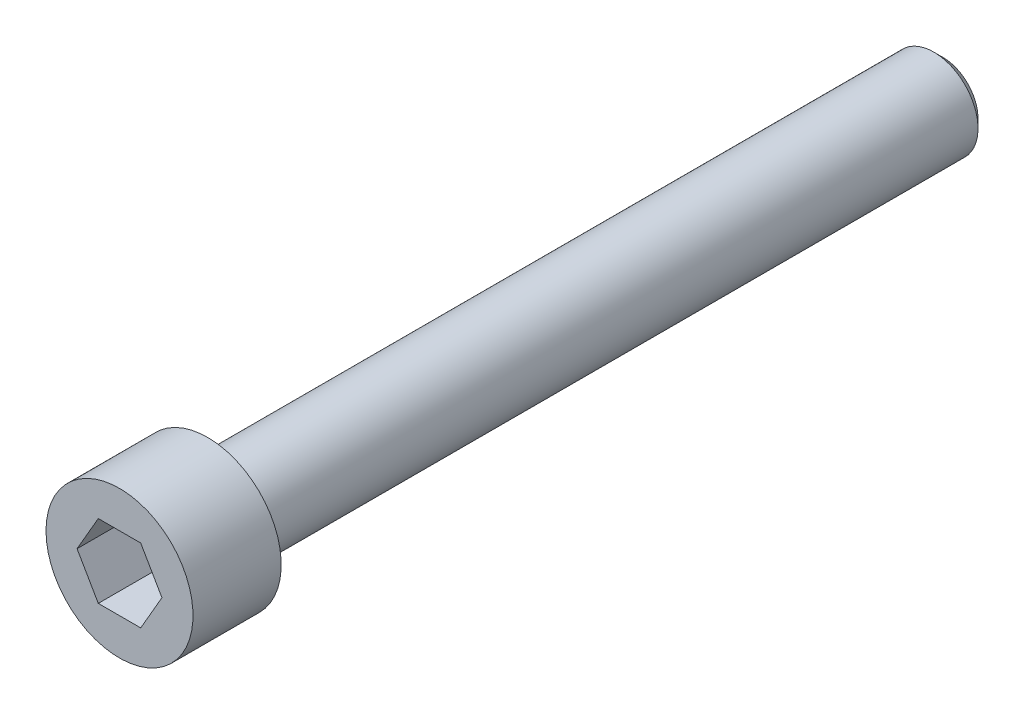
ISO-10303-21;
HEADER;
FILE_DESCRIPTION(('STEP AP214'),'2;1');
FILE_NAME('part.step','',(''),(''),'','','');
FILE_SCHEMA(('AUTOMOTIVE_DESIGN { 1 0 10303 214 1 1 1 1 }'));
ENDSEC;
DATA;
#1=APPLICATION_CONTEXT('core data for automotive mechanical design processes');
#2=APPLICATION_PROTOCOL_DEFINITION('international standard','automotive_design',2000,#1);
#3=PRODUCT_CONTEXT('',#1,'mechanical');
#4=PRODUCT('Part','Part','',(#3));
#5=PRODUCT_RELATED_PRODUCT_CATEGORY('part','',(#4));
#6=PRODUCT_DEFINITION_FORMATION('','',#4);
#7=PRODUCT_DEFINITION_CONTEXT('part definition',#1,'design');
#8=PRODUCT_DEFINITION('design','',#6,#7);
#9=PRODUCT_DEFINITION_SHAPE('','',#8);
#10=(LENGTH_UNIT() NAMED_UNIT(*) SI_UNIT(.MILLI.,.METRE.));
#11=(NAMED_UNIT(*) PLANE_ANGLE_UNIT() SI_UNIT($,.RADIAN.));
#12=(NAMED_UNIT(*) SI_UNIT($,.STERADIAN.) SOLID_ANGLE_UNIT());
#13=UNCERTAINTY_MEASURE_WITH_UNIT(LENGTH_MEASURE(1.E-05),#10,'distance_accuracy_value','');
#14=(GEOMETRIC_REPRESENTATION_CONTEXT(3) GLOBAL_UNCERTAINTY_ASSIGNED_CONTEXT((#13)) GLOBAL_UNIT_ASSIGNED_CONTEXT((#10,
#11,#12)) REPRESENTATION_CONTEXT('',''));
#15=CARTESIAN_POINT('',(0.,0.,0.));
#16=DIRECTION('',(0.,0.,1.));
#17=DIRECTION('',(1.,0.,0.));
#18=AXIS2_PLACEMENT_3D('',#15,#16,#17);
#19=CARTESIAN_POINT('',(0.,0.,0.));
#20=DIRECTION('',(0.,0.,1.));
#21=DIRECTION('',(1.,0.,0.));
#22=AXIS2_PLACEMENT_3D('',#19,#20,#21);
#23=PLANE('',#22);
#24=DIRECTION('',(0.5,0.866025403784439,0.));
#25=VECTOR('',#24,1.);
#26=CARTESIAN_POINT('',(0.721687836487033,-1.25,0.));
#27=LINE('',#26,#25);
#28=CARTESIAN_POINT('',(0.721687836487033,-1.25,0.));
#29=VERTEX_POINT('',#28);
#30=CARTESIAN_POINT('',(1.44337567297407,0.,0.));
#31=VERTEX_POINT('',#30);
#32=EDGE_CURVE('E49',#29,#31,#27,.T.);
#33=ORIENTED_EDGE('',*,*,#32,.F.);
#34=DIRECTION('',(1.,0.,0.));
#35=VECTOR('',#34,1.);
#36=CARTESIAN_POINT('',(-0.721687836487032,-1.25,0.));
#37=LINE('',#36,#35);
#38=CARTESIAN_POINT('',(-0.721687836487032,-1.25,0.));
#39=VERTEX_POINT('',#38);
#40=EDGE_CURVE('E132',#39,#29,#37,.T.);
#41=ORIENTED_EDGE('',*,*,#40,.F.);
#42=DIRECTION('',(0.5,-0.866025403784439,0.));
#43=VECTOR('',#42,1.);
#44=CARTESIAN_POINT('',(-1.44337567297406,0.,0.));
#45=LINE('',#44,#43);
#46=CARTESIAN_POINT('',(-1.44337567297406,0.,0.));
#47=VERTEX_POINT('',#46);
#48=EDGE_CURVE('E130',#47,#39,#45,.T.);
#49=ORIENTED_EDGE('',*,*,#48,.F.);
#50=DIRECTION('',(-0.5,-0.866025403784439,0.));
#51=VECTOR('',#50,1.);
#52=CARTESIAN_POINT('',(-0.721687836487032,1.25,0.));
#53=LINE('',#52,#51);
#54=CARTESIAN_POINT('',(-0.721687836487032,1.25,0.));
#55=VERTEX_POINT('',#54);
#56=EDGE_CURVE('E97',#55,#47,#53,.T.);
#57=ORIENTED_EDGE('',*,*,#56,.F.);
#58=DIRECTION('',(-1.,0.,0.));
#59=VECTOR('',#58,1.);
#60=CARTESIAN_POINT('',(0.721687836487032,1.25,0.));
#61=LINE('',#60,#59);
#62=CARTESIAN_POINT('',(0.721687836487032,1.25,0.));
#63=VERTEX_POINT('',#62);
#64=EDGE_CURVE('E126',#63,#55,#61,.T.);
#65=ORIENTED_EDGE('',*,*,#64,.F.);
#66=DIRECTION('',(-0.5,0.866025403784438,0.));
#67=VECTOR('',#66,1.);
#68=CARTESIAN_POINT('',(1.44337567297407,0.,0.));
#69=LINE('',#68,#67);
#70=EDGE_CURVE('E123',#31,#63,#69,.T.);
#71=ORIENTED_EDGE('',*,*,#70,.F.);
#72=EDGE_LOOP('',(#33,#41,#49,#57,#65,#71));
#73=FACE_BOUND('',#72,.T.);
#74=CARTESIAN_POINT('',(0.,0.,0.));
#75=DIRECTION('',(0.,0.,-1.));
#76=DIRECTION('',(-1.,0.,0.));
#77=AXIS2_PLACEMENT_3D('',#74,#75,#76);
#78=CIRCLE('',#77,2.5);
#79=CARTESIAN_POINT('',(-2.5,0.,0.));
#80=VERTEX_POINT('',#79);
#81=EDGE_CURVE('E144',#80,#80,#78,.T.);
#82=ORIENTED_EDGE('',*,*,#81,.F.);
#83=EDGE_LOOP('',(#82));
#84=FACE_BOUND('',#83,.T.);
#85=ADVANCED_FACE('F34',(#73,#84),#23,.T.);
#86=CARTESIAN_POINT('',(0.,0.,0.));
#87=DIRECTION('',(0.,0.,-1.));
#88=DIRECTION('',(-1.,0.,0.));
#89=AXIS2_PLACEMENT_3D('',#86,#87,#88);
#90=CYLINDRICAL_SURFACE('',#89,2.5);
#91=ORIENTED_EDGE('',*,*,#81,.T.);
#92=EDGE_LOOP('',(#91));
#93=FACE_BOUND('',#92,.T.);
#94=CARTESIAN_POINT('',(0.,0.,-3.));
#95=DIRECTION('',(0.,0.,-1.));
#96=DIRECTION('',(-1.,0.,0.));
#97=AXIS2_PLACEMENT_3D('',#94,#95,#96);
#98=CIRCLE('',#97,2.5);
#99=CARTESIAN_POINT('',(-2.5,0.,-3.));
#100=VERTEX_POINT('',#99);
#101=EDGE_CURVE('E136',#100,#100,#98,.T.);
#102=ORIENTED_EDGE('',*,*,#101,.F.);
#103=EDGE_LOOP('',(#102));
#104=FACE_BOUND('',#103,.T.);
#105=ADVANCED_FACE('F166',(#93,#104),#90,.T.);
#106=CARTESIAN_POINT('',(0.,2.5,-3.));
#107=DIRECTION('',(0.,0.,-1.));
#108=DIRECTION('',(-1.,0.,0.));
#109=AXIS2_PLACEMENT_3D('',#106,#107,#108);
#110=PLANE('',#109);
#111=CARTESIAN_POINT('',(0.,0.,-3.));
#112=DIRECTION('',(0.,0.,-1.));
#113=DIRECTION('',(-1.,0.,0.));
#114=AXIS2_PLACEMENT_3D('',#111,#112,#113);
#115=CIRCLE('',#114,1.8);
#116=CARTESIAN_POINT('',(-1.8,0.,-3.));
#117=VERTEX_POINT('',#116);
#118=EDGE_CURVE('E150',#117,#117,#115,.F.);
#119=ORIENTED_EDGE('',*,*,#118,.T.);
#120=EDGE_LOOP('',(#119));
#121=FACE_BOUND('',#120,.T.);
#122=ORIENTED_EDGE('',*,*,#101,.T.);
#123=EDGE_LOOP('',(#122));
#124=FACE_BOUND('',#123,.T.);
#125=ADVANCED_FACE('F172',(#121,#124),#110,.T.);
#126=CARTESIAN_POINT('',(0.,0.,0.));
#127=DIRECTION('',(0.,0.,-1.));
#128=DIRECTION('',(-1.,0.,0.));
#129=AXIS2_PLACEMENT_3D('',#126,#127,#128);
#130=CYLINDRICAL_SURFACE('',#129,1.5);
#131=CARTESIAN_POINT('',(0.,0.,-27.7));
#132=DIRECTION('',(0.,0.,-1.));
#133=DIRECTION('',(-1.,0.,0.));
#134=AXIS2_PLACEMENT_3D('',#131,#132,#133);
#135=CIRCLE('',#134,1.5);
#136=CARTESIAN_POINT('',(-1.5,0.,-27.7));
#137=VERTEX_POINT('',#136);
#138=EDGE_CURVE('E11',#137,#137,#135,.F.);
#139=ORIENTED_EDGE('',*,*,#138,.T.);
#140=EDGE_LOOP('',(#139));
#141=FACE_BOUND('',#140,.T.);
#142=CARTESIAN_POINT('',(0.,0.,-3.3));
#143=DIRECTION('',(0.,0.,-1.));
#144=DIRECTION('',(-1.,0.,0.));
#145=AXIS2_PLACEMENT_3D('',#142,#143,#144);
#146=CIRCLE('',#145,1.5);
#147=CARTESIAN_POINT('',(-1.5,0.,-3.3));
#148=VERTEX_POINT('',#147);
#149=EDGE_CURVE('E147',#148,#148,#146,.T.);
#150=ORIENTED_EDGE('',*,*,#149,.T.);
#151=EDGE_LOOP('',(#150));
#152=FACE_BOUND('',#151,.T.);
#153=ADVANCED_FACE('F179',(#141,#152),#130,.T.);
#154=CARTESIAN_POINT('',(0.,1.5,-28.));
#155=DIRECTION('',(0.,0.,-1.));
#156=DIRECTION('',(-1.,0.,0.));
#157=AXIS2_PLACEMENT_3D('',#154,#155,#156);
#158=PLANE('',#157);
#159=CARTESIAN_POINT('',(0.,0.,-28.));
#160=DIRECTION('',(0.,0.,-1.));
#161=DIRECTION('',(-1.,0.,0.));
#162=AXIS2_PLACEMENT_3D('',#159,#160,#161);
#163=CIRCLE('',#162,1.2);
#164=CARTESIAN_POINT('',(-1.2,0.,-28.));
#165=VERTEX_POINT('',#164);
#166=EDGE_CURVE('E42',#165,#165,#163,.T.);
#167=ORIENTED_EDGE('',*,*,#166,.T.);
#168=EDGE_LOOP('',(#167));
#169=FACE_BOUND('',#168,.T.);
#170=ADVANCED_FACE('F155',(#169),#158,.T.);
#171=CARTESIAN_POINT('',(0.721687836487033,-1.25,-2.));
#172=DIRECTION('',(0.866025403784439,-0.5,0.));
#173=DIRECTION('',(0.5,0.866025403784439,0.));
#174=AXIS2_PLACEMENT_3D('',#171,#172,#173);
#175=PLANE('',#174);
#176=ORIENTED_EDGE('',*,*,#32,.T.);
#177=DIRECTION('',(0.,0.,1.));
#178=VECTOR('',#177,1.);
#179=CARTESIAN_POINT('',(1.44337567297407,0.,-2.));
#180=LINE('',#179,#178);
#181=CARTESIAN_POINT('',(1.44337567297407,0.,-2.));
#182=VERTEX_POINT('',#181);
#183=EDGE_CURVE('E79',#182,#31,#180,.T.);
#184=ORIENTED_EDGE('',*,*,#183,.F.);
#185=DIRECTION('',(0.5,0.866025403784439,0.));
#186=VECTOR('',#185,1.);
#187=CARTESIAN_POINT('',(0.721687836487033,-1.25,-2.));
#188=LINE('',#187,#186);
#189=CARTESIAN_POINT('',(0.721687836487033,-1.25,-2.));
#190=VERTEX_POINT('',#189);
#191=EDGE_CURVE('E134',#190,#182,#188,.T.);
#192=ORIENTED_EDGE('',*,*,#191,.F.);
#193=DIRECTION('',(0.,0.,1.));
#194=VECTOR('',#193,1.);
#195=CARTESIAN_POINT('',(0.721687836487033,-1.25,-2.));
#196=LINE('',#195,#194);
#197=EDGE_CURVE('E57',#190,#29,#196,.T.);
#198=ORIENTED_EDGE('',*,*,#197,.T.);
#199=EDGE_LOOP('',(#176,#184,#192,#198));
#200=FACE_BOUND('',#199,.T.);
#201=ADVANCED_FACE('F186',(#200),#175,.F.);
#202=CARTESIAN_POINT('',(-0.721687836487032,-1.25,-2.));
#203=DIRECTION('',(0.,-1.,0.));
#204=DIRECTION('',(0.,0.,-1.));
#205=AXIS2_PLACEMENT_3D('',#202,#203,#204);
#206=PLANE('',#205);
#207=ORIENTED_EDGE('',*,*,#40,.T.);
#208=ORIENTED_EDGE('',*,*,#197,.F.);
#209=DIRECTION('',(1.,0.,0.));
#210=VECTOR('',#209,1.);
#211=CARTESIAN_POINT('',(-0.721687836487032,-1.25,-2.));
#212=LINE('',#211,#210);
#213=CARTESIAN_POINT('',(-0.721687836487032,-1.25,-2.));
#214=VERTEX_POINT('',#213);
#215=EDGE_CURVE('E109',#214,#190,#212,.T.);
#216=ORIENTED_EDGE('',*,*,#215,.F.);
#217=DIRECTION('',(0.,0.,1.));
#218=VECTOR('',#217,1.);
#219=CARTESIAN_POINT('',(-0.721687836487032,-1.25,-2.));
#220=LINE('',#219,#218);
#221=EDGE_CURVE('E101',#214,#39,#220,.T.);
#222=ORIENTED_EDGE('',*,*,#221,.T.);
#223=EDGE_LOOP('',(#207,#208,#216,#222));
#224=FACE_BOUND('',#223,.T.);
#225=ADVANCED_FACE('F189',(#224),#206,.F.);
#226=CARTESIAN_POINT('',(-1.44337567297406,0.,-2.));
#227=DIRECTION('',(-0.866025403784439,-0.5,0.));
#228=DIRECTION('',(0.5,-0.866025403784439,0.));
#229=AXIS2_PLACEMENT_3D('',#226,#227,#228);
#230=PLANE('',#229);
#231=ORIENTED_EDGE('',*,*,#48,.T.);
#232=ORIENTED_EDGE('',*,*,#221,.F.);
#233=DIRECTION('',(0.5,-0.866025403784439,0.));
#234=VECTOR('',#233,1.);
#235=CARTESIAN_POINT('',(-1.44337567297406,0.,-2.));
#236=LINE('',#235,#234);
#237=CARTESIAN_POINT('',(-1.44337567297406,0.,-2.));
#238=VERTEX_POINT('',#237);
#239=EDGE_CURVE('E105',#238,#214,#236,.T.);
#240=ORIENTED_EDGE('',*,*,#239,.F.);
#241=DIRECTION('',(0.,0.,1.));
#242=VECTOR('',#241,1.);
#243=CARTESIAN_POINT('',(-1.44337567297406,0.,-2.));
#244=LINE('',#243,#242);
#245=EDGE_CURVE('E90',#238,#47,#244,.T.);
#246=ORIENTED_EDGE('',*,*,#245,.T.);
#247=EDGE_LOOP('',(#231,#232,#240,#246));
#248=FACE_BOUND('',#247,.T.);
#249=ADVANCED_FACE('F106',(#248),#230,.F.);
#250=CARTESIAN_POINT('',(-0.721687836487032,1.25,-2.));
#251=DIRECTION('',(-0.866025403784439,0.5,0.));
#252=DIRECTION('',(-0.5,-0.866025403784439,0.));
#253=AXIS2_PLACEMENT_3D('',#250,#251,#252);
#254=PLANE('',#253);
#255=ORIENTED_EDGE('',*,*,#56,.T.);
#256=ORIENTED_EDGE('',*,*,#245,.F.);
#257=DIRECTION('',(-0.5,-0.866025403784439,0.));
#258=VECTOR('',#257,1.);
#259=CARTESIAN_POINT('',(-0.721687836487032,1.25,-2.));
#260=LINE('',#259,#258);
#261=CARTESIAN_POINT('',(-0.721687836487032,1.25,-2.));
#262=VERTEX_POINT('',#261);
#263=EDGE_CURVE('E94',#262,#238,#260,.T.);
#264=ORIENTED_EDGE('',*,*,#263,.F.);
#265=DIRECTION('',(0.,0.,1.));
#266=VECTOR('',#265,1.);
#267=CARTESIAN_POINT('',(-0.721687836487032,1.25,-2.));
#268=LINE('',#267,#266);
#269=EDGE_CURVE('E102',#262,#55,#268,.T.);
#270=ORIENTED_EDGE('',*,*,#269,.T.);
#271=EDGE_LOOP('',(#255,#256,#264,#270));
#272=FACE_BOUND('',#271,.T.);
#273=ADVANCED_FACE('F92',(#272),#254,.F.);
#274=CARTESIAN_POINT('',(0.721687836487032,1.25,-2.));
#275=DIRECTION('',(0.,1.,0.));
#276=DIRECTION('',(0.,0.,1.));
#277=AXIS2_PLACEMENT_3D('',#274,#275,#276);
#278=PLANE('',#277);
#279=ORIENTED_EDGE('',*,*,#64,.T.);
#280=ORIENTED_EDGE('',*,*,#269,.F.);
#281=DIRECTION('',(-1.,0.,0.));
#282=VECTOR('',#281,1.);
#283=CARTESIAN_POINT('',(0.721687836487032,1.25,-2.));
#284=LINE('',#283,#282);
#285=CARTESIAN_POINT('',(0.721687836487032,1.25,-2.));
#286=VERTEX_POINT('',#285);
#287=EDGE_CURVE('E115',#286,#262,#284,.T.);
#288=ORIENTED_EDGE('',*,*,#287,.F.);
#289=DIRECTION('',(0.,0.,1.));
#290=VECTOR('',#289,1.);
#291=CARTESIAN_POINT('',(0.721687836487032,1.25,-2.));
#292=LINE('',#291,#290);
#293=EDGE_CURVE('E139',#286,#63,#292,.T.);
#294=ORIENTED_EDGE('',*,*,#293,.T.);
#295=EDGE_LOOP('',(#279,#280,#288,#294));
#296=FACE_BOUND('',#295,.T.);
#297=ADVANCED_FACE('F193',(#296),#278,.F.);
#298=CARTESIAN_POINT('',(1.44337567297407,0.,-2.));
#299=DIRECTION('',(0.866025403784438,0.5,0.));
#300=DIRECTION('',(-0.5,0.866025403784438,0.));
#301=AXIS2_PLACEMENT_3D('',#298,#299,#300);
#302=PLANE('',#301);
#303=ORIENTED_EDGE('',*,*,#70,.T.);
#304=ORIENTED_EDGE('',*,*,#293,.F.);
#305=DIRECTION('',(-0.5,0.866025403784438,0.));
#306=VECTOR('',#305,1.);
#307=CARTESIAN_POINT('',(1.44337567297407,0.,-2.));
#308=LINE('',#307,#306);
#309=EDGE_CURVE('E117',#182,#286,#308,.T.);
#310=ORIENTED_EDGE('',*,*,#309,.F.);
#311=ORIENTED_EDGE('',*,*,#183,.T.);
#312=EDGE_LOOP('',(#303,#304,#310,#311));
#313=FACE_BOUND('',#312,.T.);
#314=ADVANCED_FACE('F190',(#313),#302,.F.);
#315=CARTESIAN_POINT('',(0.,0.,-2.));
#316=DIRECTION('',(0.,0.,1.));
#317=DIRECTION('',(1.,0.,0.));
#318=AXIS2_PLACEMENT_3D('',#315,#316,#317);
#319=PLANE('',#318);
#320=ORIENTED_EDGE('',*,*,#191,.T.);
#321=ORIENTED_EDGE('',*,*,#309,.T.);
#322=ORIENTED_EDGE('',*,*,#287,.T.);
#323=ORIENTED_EDGE('',*,*,#263,.T.);
#324=ORIENTED_EDGE('',*,*,#239,.T.);
#325=ORIENTED_EDGE('',*,*,#215,.T.);
#326=EDGE_LOOP('',(#320,#321,#322,#323,#324,#325));
#327=FACE_BOUND('',#326,.T.);
#328=ADVANCED_FACE('F112',(#327),#319,.T.);
#329=CARTESIAN_POINT('',(0.,0.,-3.3));
#330=DIRECTION('',(0.,0.,-1.));
#331=DIRECTION('',(-1.,0.,0.));
#332=AXIS2_PLACEMENT_3D('',#329,#330,#331);
#333=TOROIDAL_SURFACE('',#332,1.8,0.3);
#334=ORIENTED_EDGE('',*,*,#118,.F.);
#335=EDGE_LOOP('',(#334));
#336=FACE_BOUND('',#335,.T.);
#337=ORIENTED_EDGE('',*,*,#149,.F.);
#338=EDGE_LOOP('',(#337));
#339=FACE_BOUND('',#338,.T.);
#340=ADVANCED_FACE('F158',(#336,#339),#333,.F.);
#341=CARTESIAN_POINT('',(0.,0.,-28.));
#342=DIRECTION('',(0.,0.,1.));
#343=DIRECTION('',(1.,0.,0.));
#344=AXIS2_PLACEMENT_3D('',#341,#342,#343);
#345=CONICAL_SURFACE('',#344,1.2,0.785398163397447);
#346=ORIENTED_EDGE('',*,*,#138,.F.);
#347=EDGE_LOOP('',(#346));
#348=FACE_BOUND('',#347,.T.);
#349=ORIENTED_EDGE('',*,*,#166,.F.);
#350=EDGE_LOOP('',(#349));
#351=FACE_BOUND('',#350,.T.);
#352=ADVANCED_FACE('F36',(#348,#351),#345,.T.);
#353=CLOSED_SHELL('',(#85,#105,#125,#153,#170,#201,#225,#249,#273,#297,#314,#328,#340,#352));
#354=MANIFOLD_SOLID_BREP('B2',#353);
#355=ADVANCED_BREP_SHAPE_REPRESENTATION('',(#18,#354),#14);
#356=SHAPE_DEFINITION_REPRESENTATION(#9,#355);
ENDSEC;
END-ISO-10303-21;
